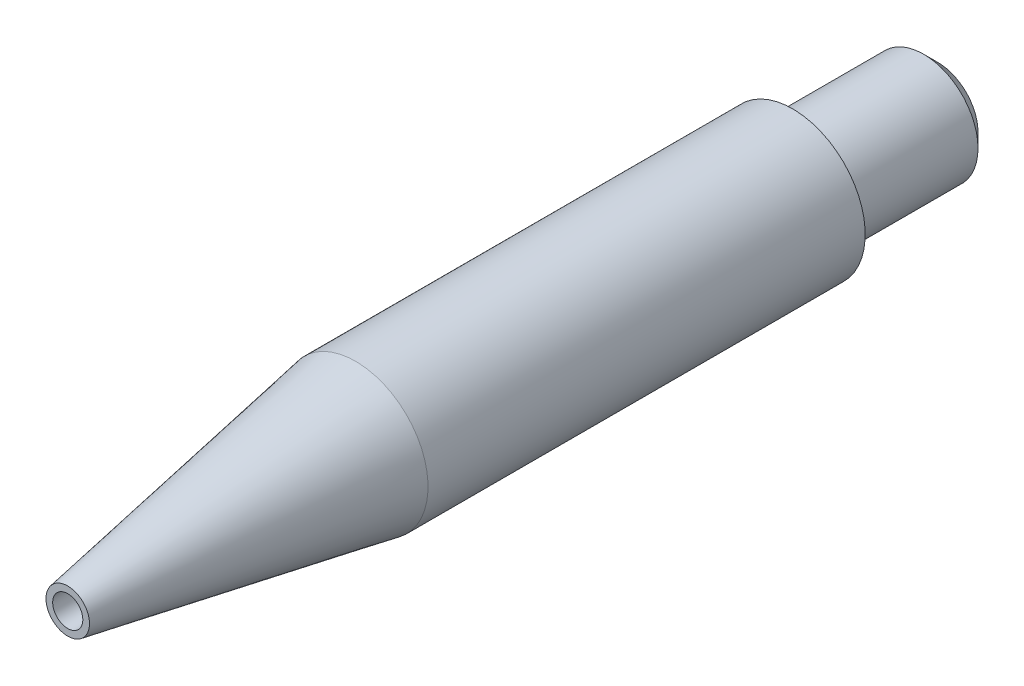
ISO-10303-21;
HEADER;
FILE_DESCRIPTION(('STEP AP214'),'2;1');
FILE_NAME('part.step','',(''),(''),'','','');
FILE_SCHEMA(('AUTOMOTIVE_DESIGN { 1 0 10303 214 1 1 1 1 }'));
ENDSEC;
DATA;
#1=APPLICATION_CONTEXT('core data for automotive mechanical design processes');
#2=APPLICATION_PROTOCOL_DEFINITION('international standard','automotive_design',2000,#1);
#3=PRODUCT_CONTEXT('',#1,'mechanical');
#4=PRODUCT('Part','Part','',(#3));
#5=PRODUCT_RELATED_PRODUCT_CATEGORY('part','',(#4));
#6=PRODUCT_DEFINITION_FORMATION('','',#4);
#7=PRODUCT_DEFINITION_CONTEXT('part definition',#1,'design');
#8=PRODUCT_DEFINITION('design','',#6,#7);
#9=PRODUCT_DEFINITION_SHAPE('','',#8);
#10=(LENGTH_UNIT() NAMED_UNIT(*) SI_UNIT(.MILLI.,.METRE.));
#11=(NAMED_UNIT(*) PLANE_ANGLE_UNIT() SI_UNIT($,.RADIAN.));
#12=(NAMED_UNIT(*) SI_UNIT($,.STERADIAN.) SOLID_ANGLE_UNIT());
#13=UNCERTAINTY_MEASURE_WITH_UNIT(LENGTH_MEASURE(1.E-05),#10,'distance_accuracy_value','');
#14=(GEOMETRIC_REPRESENTATION_CONTEXT(3) GLOBAL_UNCERTAINTY_ASSIGNED_CONTEXT((#13)) GLOBAL_UNIT_ASSIGNED_CONTEXT((#10,
#11,#12)) REPRESENTATION_CONTEXT('',''));
#15=CARTESIAN_POINT('',(0.,0.,0.));
#16=DIRECTION('',(0.,0.,1.));
#17=DIRECTION('',(1.,0.,0.));
#18=AXIS2_PLACEMENT_3D('',#15,#16,#17);
#19=CARTESIAN_POINT('',(0.,0.,0.));
#20=DIRECTION('',(0.,0.,1.));
#21=DIRECTION('',(1.,0.,0.));
#22=AXIS2_PLACEMENT_3D('',#19,#20,#21);
#23=PLANE('',#22);
#24=CARTESIAN_POINT('',(0.,0.,0.));
#25=DIRECTION('',(0.,0.,-1.));
#26=DIRECTION('',(-1.,0.,0.));
#27=AXIS2_PLACEMENT_3D('',#24,#25,#26);
#28=CIRCLE('',#27,3.17499999999999);
#29=CARTESIAN_POINT('',(-3.175,0.,0.));
#30=VERTEX_POINT('',#29);
#31=EDGE_CURVE('E59',#30,#30,#28,.T.);
#32=ORIENTED_EDGE('',*,*,#31,.F.);
#33=EDGE_LOOP('',(#32));
#34=FACE_BOUND('',#33,.T.);
#35=CARTESIAN_POINT('',(0.,0.,0.));
#36=DIRECTION('',(0.,0.,1.));
#37=DIRECTION('',(1.,0.,0.));
#38=AXIS2_PLACEMENT_3D('',#35,#36,#37);
#39=CIRCLE('',#38,3.5306);
#40=CARTESIAN_POINT('',(3.53060000000001,0.,0.));
#41=VERTEX_POINT('',#40);
#42=EDGE_CURVE('E74',#41,#41,#39,.T.);
#43=ORIENTED_EDGE('',*,*,#42,.F.);
#44=EDGE_LOOP('',(#43));
#45=FACE_BOUND('',#44,.T.);
#46=ADVANCED_FACE('F36',(#34,#45),#23,.F.);
#47=CARTESIAN_POINT('',(0.,0.,76.2));
#48=DIRECTION('',(0.,0.,-1.));
#49=DIRECTION('',(-1.,0.,0.));
#50=AXIS2_PLACEMENT_3D('',#47,#48,#49);
#51=CYLINDRICAL_SURFACE('',#50,6.35);
#52=CARTESIAN_POINT('',(0.,0.,50.9911523117993));
#53=DIRECTION('',(0.,0.,-1.));
#54=DIRECTION('',(-1.,0.,0.));
#55=AXIS2_PLACEMENT_3D('',#52,#53,#54);
#56=CIRCLE('',#55,6.35);
#57=CARTESIAN_POINT('',(-6.35000000000001,0.,50.9911523117993));
#58=VERTEX_POINT('',#57);
#59=EDGE_CURVE('E44',#58,#58,#56,.T.);
#60=ORIENTED_EDGE('',*,*,#59,.T.);
#61=EDGE_LOOP('',(#60));
#62=FACE_BOUND('',#61,.T.);
#63=CARTESIAN_POINT('',(0.,0.,12.7));
#64=DIRECTION('',(0.,0.,-1.));
#65=DIRECTION('',(-1.,0.,0.));
#66=AXIS2_PLACEMENT_3D('',#63,#64,#65);
#67=CIRCLE('',#66,6.35);
#68=CARTESIAN_POINT('',(-6.35000000000002,0.,12.7));
#69=VERTEX_POINT('',#68);
#70=EDGE_CURVE('E53',#69,#69,#67,.T.);
#71=ORIENTED_EDGE('',*,*,#70,.F.);
#72=EDGE_LOOP('',(#71));
#73=FACE_BOUND('',#72,.T.);
#74=ADVANCED_FACE('F38',(#62,#73),#51,.T.);
#75=CARTESIAN_POINT('',(0.,0.,50.9911523117993));
#76=DIRECTION('',(0.,0.,-1.));
#77=DIRECTION('',(-1.,0.,0.));
#78=AXIS2_PLACEMENT_3D('',#75,#76,#77);
#79=CONICAL_SURFACE('',#78,6.35,0.174532925199434);
#80=CARTESIAN_POINT('',(0.,0.,76.2));
#81=DIRECTION('',(0.,0.,-1.));
#82=DIRECTION('',(-1.,0.,0.));
#83=AXIS2_PLACEMENT_3D('',#80,#81,#82);
#84=CIRCLE('',#83,1.90499999999999);
#85=CARTESIAN_POINT('',(-1.90499999999999,0.,76.2));
#86=VERTEX_POINT('',#85);
#87=EDGE_CURVE('E10',#86,#86,#84,.T.);
#88=ORIENTED_EDGE('',*,*,#87,.T.);
#89=EDGE_LOOP('',(#88));
#90=FACE_BOUND('',#89,.T.);
#91=ORIENTED_EDGE('',*,*,#59,.F.);
#92=EDGE_LOOP('',(#91));
#93=FACE_BOUND('',#92,.T.);
#94=ADVANCED_FACE('F85',(#90,#93),#79,.T.);
#95=CARTESIAN_POINT('',(0.,0.,76.2));
#96=DIRECTION('',(0.,0.,1.));
#97=DIRECTION('',(1.,0.,0.));
#98=AXIS2_PLACEMENT_3D('',#95,#96,#97);
#99=PLANE('',#98);
#100=CARTESIAN_POINT('',(0.,0.,76.2));
#101=DIRECTION('',(0.,0.,1.));
#102=DIRECTION('',(1.,0.,0.));
#103=AXIS2_PLACEMENT_3D('',#100,#101,#102);
#104=CIRCLE('',#103,1.3208);
#105=CARTESIAN_POINT('',(1.3208,0.,76.2));
#106=VERTEX_POINT('',#105);
#107=EDGE_CURVE('E48',#106,#106,#104,.T.);
#108=ORIENTED_EDGE('',*,*,#107,.F.);
#109=EDGE_LOOP('',(#108));
#110=FACE_BOUND('',#109,.T.);
#111=ORIENTED_EDGE('',*,*,#87,.F.);
#112=EDGE_LOOP('',(#111));
#113=FACE_BOUND('',#112,.T.);
#114=ADVANCED_FACE('F89',(#110,#113),#99,.T.);
#115=CARTESIAN_POINT('',(0.,0.,0.));
#116=DIRECTION('',(0.,0.,1.));
#117=DIRECTION('',(1.,0.,0.));
#118=AXIS2_PLACEMENT_3D('',#115,#116,#117);
#119=CYLINDRICAL_SURFACE('',#118,1.3208);
#120=CARTESIAN_POINT('',(0.,0.,64.6141157598009));
#121=DIRECTION('',(0.,0.,-1.));
#122=DIRECTION('',(-1.,0.,0.));
#123=AXIS2_PLACEMENT_3D('',#120,#121,#122);
#124=CIRCLE('',#123,1.3208);
#125=CARTESIAN_POINT('',(-1.3208,0.,64.6141157598009));
#126=VERTEX_POINT('',#125);
#127=EDGE_CURVE('E40',#126,#126,#124,.T.);
#128=ORIENTED_EDGE('',*,*,#127,.T.);
#129=EDGE_LOOP('',(#128));
#130=FACE_BOUND('',#129,.T.);
#131=ORIENTED_EDGE('',*,*,#107,.T.);
#132=EDGE_LOOP('',(#131));
#133=FACE_BOUND('',#132,.T.);
#134=ADVANCED_FACE('F92',(#130,#133),#119,.F.);
#135=CARTESIAN_POINT('',(0.,0.,12.7));
#136=DIRECTION('',(0.,0.,-1.));
#137=DIRECTION('',(-1.,0.,0.));
#138=AXIS2_PLACEMENT_3D('',#135,#136,#137);
#139=PLANE('',#138);
#140=ORIENTED_EDGE('',*,*,#70,.T.);
#141=EDGE_LOOP('',(#140));
#142=FACE_BOUND('',#141,.T.);
#143=CARTESIAN_POINT('',(0.,0.,12.7));
#144=DIRECTION('',(0.,0.,1.));
#145=DIRECTION('',(1.,0.,0.));
#146=AXIS2_PLACEMENT_3D('',#143,#144,#145);
#147=CIRCLE('',#146,4.1656);
#148=CARTESIAN_POINT('',(4.16560000000001,0.,12.7));
#149=VERTEX_POINT('',#148);
#150=EDGE_CURVE('E62',#149,#149,#147,.T.);
#151=ORIENTED_EDGE('',*,*,#150,.T.);
#152=EDGE_LOOP('',(#151));
#153=FACE_BOUND('',#152,.T.);
#154=ADVANCED_FACE('F98',(#142,#153),#139,.T.);
#155=CARTESIAN_POINT('',(0.,0.,12.7));
#156=DIRECTION('',(0.,0.,-1.));
#157=DIRECTION('',(-1.,0.,0.));
#158=AXIS2_PLACEMENT_3D('',#155,#156,#157);
#159=CYLINDRICAL_SURFACE('',#158,4.7625);
#160=CARTESIAN_POINT('',(0.,0.,1.23189999999999));
#161=DIRECTION('',(0.,0.,1.));
#162=DIRECTION('',(1.,0.,0.));
#163=AXIS2_PLACEMENT_3D('',#160,#161,#162);
#164=CIRCLE('',#163,4.7625);
#165=CARTESIAN_POINT('',(4.76250000000001,0.,1.23189999999999));
#166=VERTEX_POINT('',#165);
#167=EDGE_CURVE('E71',#166,#166,#164,.T.);
#168=ORIENTED_EDGE('',*,*,#167,.T.);
#169=EDGE_LOOP('',(#168));
#170=FACE_BOUND('',#169,.T.);
#171=CARTESIAN_POINT('',(0.,0.,11.684));
#172=DIRECTION('',(0.,0.,1.));
#173=DIRECTION('',(1.,0.,0.));
#174=AXIS2_PLACEMENT_3D('',#171,#172,#173);
#175=CIRCLE('',#174,4.7625);
#176=CARTESIAN_POINT('',(4.76250000000001,0.,11.684));
#177=VERTEX_POINT('',#176);
#178=EDGE_CURVE('E68',#177,#177,#175,.T.);
#179=ORIENTED_EDGE('',*,*,#178,.F.);
#180=EDGE_LOOP('',(#179));
#181=FACE_BOUND('',#180,.T.);
#182=ADVANCED_FACE('F102',(#170,#181),#159,.T.);
#183=CARTESIAN_POINT('',(0.,0.,63.5));
#184=DIRECTION('',(0.,0.,-1.));
#185=DIRECTION('',(-1.,0.,0.));
#186=AXIS2_PLACEMENT_3D('',#183,#184,#185);
#187=CONICAL_SURFACE('',#186,3.17499999999998,1.02974425867665);
#188=CARTESIAN_POINT('',(0.,0.,63.5));
#189=DIRECTION('',(0.,0.,-1.));
#190=DIRECTION('',(-1.,0.,0.));
#191=AXIS2_PLACEMENT_3D('',#188,#189,#190);
#192=CIRCLE('',#191,3.17499999999998);
#193=CARTESIAN_POINT('',(-3.17499999999999,0.,63.5));
#194=VERTEX_POINT('',#193);
#195=EDGE_CURVE('E56',#194,#194,#192,.T.);
#196=ORIENTED_EDGE('',*,*,#195,.T.);
#197=EDGE_LOOP('',(#196));
#198=FACE_BOUND('',#197,.T.);
#199=ORIENTED_EDGE('',*,*,#127,.F.);
#200=EDGE_LOOP('',(#199));
#201=FACE_BOUND('',#200,.T.);
#202=ADVANCED_FACE('F106',(#198,#201),#187,.F.);
#203=CARTESIAN_POINT('',(0.,0.,0.));
#204=DIRECTION('',(0.,0.,-1.));
#205=DIRECTION('',(-1.,0.,0.));
#206=AXIS2_PLACEMENT_3D('',#203,#204,#205);
#207=CYLINDRICAL_SURFACE('',#206,3.17499999999999);
#208=ORIENTED_EDGE('',*,*,#195,.F.);
#209=EDGE_LOOP('',(#208));
#210=FACE_BOUND('',#209,.T.);
#211=ORIENTED_EDGE('',*,*,#31,.T.);
#212=EDGE_LOOP('',(#211));
#213=FACE_BOUND('',#212,.T.);
#214=ADVANCED_FACE('F110',(#210,#213),#207,.F.);
#215=CARTESIAN_POINT('',(0.,0.,12.192));
#216=DIRECTION('',(0.,0.,1.));
#217=DIRECTION('',(1.,0.,0.));
#218=AXIS2_PLACEMENT_3D('',#215,#216,#217);
#219=TOROIDAL_SURFACE('',#218,4.1656,0.508000000000002);
#220=ORIENTED_EDGE('',*,*,#150,.F.);
#221=EDGE_LOOP('',(#220));
#222=FACE_BOUND('',#221,.T.);
#223=CARTESIAN_POINT('',(0.,0.,11.684));
#224=DIRECTION('',(0.,0.,1.));
#225=DIRECTION('',(1.,0.,0.));
#226=AXIS2_PLACEMENT_3D('',#223,#224,#225);
#227=CIRCLE('',#226,4.1656);
#228=CARTESIAN_POINT('',(4.16560000000001,0.,11.684));
#229=VERTEX_POINT('',#228);
#230=EDGE_CURVE('E65',#229,#229,#227,.T.);
#231=ORIENTED_EDGE('',*,*,#230,.T.);
#232=EDGE_LOOP('',(#231));
#233=FACE_BOUND('',#232,.T.);
#234=ADVANCED_FACE('F114',(#222,#233),#219,.F.);
#235=CARTESIAN_POINT('',(4.7625,0.,11.684));
#236=DIRECTION('',(0.,0.,-1.));
#237=DIRECTION('',(-1.,0.,0.));
#238=AXIS2_PLACEMENT_3D('',#235,#236,#237);
#239=PLANE('',#238);
#240=ORIENTED_EDGE('',*,*,#230,.F.);
#241=EDGE_LOOP('',(#240));
#242=FACE_BOUND('',#241,.T.);
#243=ORIENTED_EDGE('',*,*,#178,.T.);
#244=EDGE_LOOP('',(#243));
#245=FACE_BOUND('',#244,.T.);
#246=ADVANCED_FACE('F118',(#242,#245),#239,.F.);
#247=CARTESIAN_POINT('',(0.,0.,0.));
#248=DIRECTION('',(0.,0.,1.));
#249=DIRECTION('',(1.,0.,0.));
#250=AXIS2_PLACEMENT_3D('',#247,#248,#249);
#251=CONICAL_SURFACE('',#250,3.5306,0.785398163397448);
#252=ORIENTED_EDGE('',*,*,#167,.F.);
#253=EDGE_LOOP('',(#252));
#254=FACE_BOUND('',#253,.T.);
#255=ORIENTED_EDGE('',*,*,#42,.T.);
#256=EDGE_LOOP('',(#255));
#257=FACE_BOUND('',#256,.T.);
#258=ADVANCED_FACE('F78',(#254,#257),#251,.T.);
#259=CLOSED_SHELL('',(#46,#74,#94,#114,#134,#154,#182,#202,#214,#234,#246,#258));
#260=MANIFOLD_SOLID_BREP('B2',#259);
#261=ADVANCED_BREP_SHAPE_REPRESENTATION('',(#18,#260),#14);
#262=SHAPE_DEFINITION_REPRESENTATION(#9,#261);
ENDSEC;
END-ISO-10303-21;
